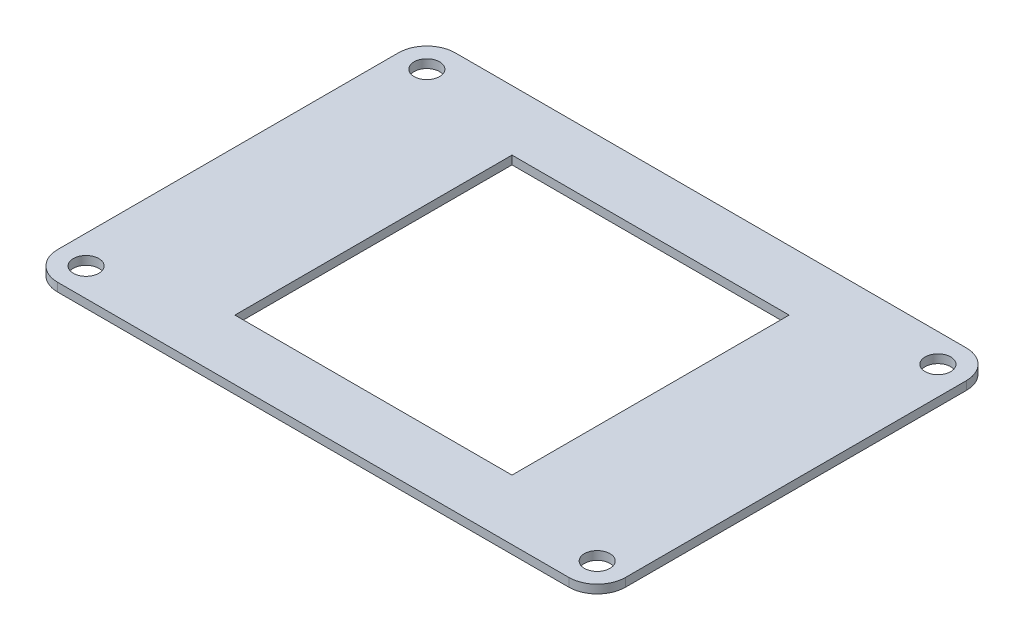
ISO-10303-21;
HEADER;
FILE_DESCRIPTION(('STEP AP214'),'2;1');
FILE_NAME('part.step','',(''),(''),'','','');
FILE_SCHEMA(('AUTOMOTIVE_DESIGN { 1 0 10303 214 1 1 1 1 }'));
ENDSEC;
DATA;
#1=APPLICATION_CONTEXT('core data for automotive mechanical design processes');
#2=APPLICATION_PROTOCOL_DEFINITION('international standard','automotive_design',2000,#1);
#3=PRODUCT_CONTEXT('',#1,'mechanical');
#4=PRODUCT('Part','Part','',(#3));
#5=PRODUCT_RELATED_PRODUCT_CATEGORY('part','',(#4));
#6=PRODUCT_DEFINITION_FORMATION('','',#4);
#7=PRODUCT_DEFINITION_CONTEXT('part definition',#1,'design');
#8=PRODUCT_DEFINITION('design','',#6,#7);
#9=PRODUCT_DEFINITION_SHAPE('','',#8);
#10=(LENGTH_UNIT() NAMED_UNIT(*) SI_UNIT(.MILLI.,.METRE.));
#11=(NAMED_UNIT(*) PLANE_ANGLE_UNIT() SI_UNIT($,.RADIAN.));
#12=(NAMED_UNIT(*) SI_UNIT($,.STERADIAN.) SOLID_ANGLE_UNIT());
#13=UNCERTAINTY_MEASURE_WITH_UNIT(LENGTH_MEASURE(1.E-05),#10,'distance_accuracy_value','');
#14=(GEOMETRIC_REPRESENTATION_CONTEXT(3) GLOBAL_UNCERTAINTY_ASSIGNED_CONTEXT((#13)) GLOBAL_UNIT_ASSIGNED_CONTEXT((#10,
#11,#12)) REPRESENTATION_CONTEXT('',''));
#15=CARTESIAN_POINT('',(0.,0.,0.));
#16=DIRECTION('',(0.,0.,1.));
#17=DIRECTION('',(1.,0.,0.));
#18=AXIS2_PLACEMENT_3D('',#15,#16,#17);
#19=CARTESIAN_POINT('',(-100.,-3.,69.9999999999992));
#20=DIRECTION('',(-1.,0.,0.));
#21=DIRECTION('',(0.,0.,1.));
#22=AXIS2_PLACEMENT_3D('',#19,#20,#21);
#23=PLANE('',#22);
#24=DIRECTION('',(0.,0.,1.));
#25=VECTOR('',#24,1.);
#26=CARTESIAN_POINT('',(-100.,-3.,69.9999999999992));
#27=LINE('',#26,#25);
#28=CARTESIAN_POINT('',(-100.,-3.,-60.));
#29=VERTEX_POINT('',#28);
#30=CARTESIAN_POINT('',(-99.9999999999995,-3.,59.9999999999992));
#31=VERTEX_POINT('',#30);
#32=EDGE_CURVE('E193',#29,#31,#27,.T.);
#33=ORIENTED_EDGE('',*,*,#32,.T.);
#34=DIRECTION('',(0.,1.,0.));
#35=VECTOR('',#34,1.);
#36=CARTESIAN_POINT('',(-99.9999999999995,-3.,59.9999999999992));
#37=LINE('',#36,#35);
#38=CARTESIAN_POINT('',(-99.9999999999998,0.,59.9999999999992));
#39=VERTEX_POINT('',#38);
#40=EDGE_CURVE('E226',#31,#39,#37,.T.);
#41=ORIENTED_EDGE('',*,*,#40,.T.);
#42=DIRECTION('',(0.,0.,1.));
#43=VECTOR('',#42,1.);
#44=CARTESIAN_POINT('',(-100.,0.,69.9999999999992));
#45=LINE('',#44,#43);
#46=CARTESIAN_POINT('',(-100.,0.,-60.));
#47=VERTEX_POINT('',#46);
#48=EDGE_CURVE('E187',#47,#39,#45,.T.);
#49=ORIENTED_EDGE('',*,*,#48,.F.);
#50=DIRECTION('',(0.,1.,0.));
#51=VECTOR('',#50,1.);
#52=CARTESIAN_POINT('',(-100.,-3.,-60.));
#53=LINE('',#52,#51);
#54=EDGE_CURVE('E209',#47,#29,#53,.F.);
#55=ORIENTED_EDGE('',*,*,#54,.T.);
#56=EDGE_LOOP('',(#33,#41,#49,#55));
#57=FACE_BOUND('',#56,.T.);
#58=ADVANCED_FACE('F42',(#57),#23,.T.);
#59=CARTESIAN_POINT('',(100.,-2.99999999999934,-70.));
#60=DIRECTION('',(0.,0.,-1.));
#61=DIRECTION('',(-1.,0.,0.));
#62=AXIS2_PLACEMENT_3D('',#59,#60,#61);
#63=PLANE('',#62);
#64=DIRECTION('',(-1.,0.,0.));
#65=VECTOR('',#64,1.);
#66=CARTESIAN_POINT('',(100.,6.66133814775094E-13,-70.));
#67=LINE('',#66,#65);
#68=CARTESIAN_POINT('',(90.0000000000002,4.9960036108132E-13,-70.));
#69=VERTEX_POINT('',#68);
#70=CARTESIAN_POINT('',(-89.9999999999998,4.9960036108132E-13,-70.));
#71=VERTEX_POINT('',#70);
#72=EDGE_CURVE('E198',#69,#71,#67,.T.);
#73=ORIENTED_EDGE('',*,*,#72,.F.);
#74=DIRECTION('',(0.,1.,0.));
#75=VECTOR('',#74,1.);
#76=CARTESIAN_POINT('',(90.0000000000005,-2.9999999999995,-70.));
#77=LINE('',#76,#75);
#78=CARTESIAN_POINT('',(90.0000000000005,-2.9999999999995,-70.));
#79=VERTEX_POINT('',#78);
#80=EDGE_CURVE('E11',#69,#79,#77,.F.);
#81=ORIENTED_EDGE('',*,*,#80,.T.);
#82=DIRECTION('',(-1.,0.,0.));
#83=VECTOR('',#82,1.);
#84=CARTESIAN_POINT('',(100.,-2.99999999999934,-70.));
#85=LINE('',#84,#83);
#86=CARTESIAN_POINT('',(-89.9999999999995,-2.9999999999995,-70.));
#87=VERTEX_POINT('',#86);
#88=EDGE_CURVE('E205',#79,#87,#85,.T.);
#89=ORIENTED_EDGE('',*,*,#88,.T.);
#90=DIRECTION('',(0.,1.,0.));
#91=VECTOR('',#90,1.);
#92=CARTESIAN_POINT('',(-89.9999999999995,-2.9999999999995,-70.));
#93=LINE('',#92,#91);
#94=EDGE_CURVE('E51',#87,#71,#93,.T.);
#95=ORIENTED_EDGE('',*,*,#94,.T.);
#96=EDGE_LOOP('',(#73,#81,#89,#95));
#97=FACE_BOUND('',#96,.T.);
#98=ADVANCED_FACE('F272',(#97),#63,.T.);
#99=CARTESIAN_POINT('',(100.,-2.99999999999995,70.));
#100=DIRECTION('',(1.,0.,0.));
#101=DIRECTION('',(0.,0.,-1.));
#102=AXIS2_PLACEMENT_3D('',#99,#100,#101);
#103=PLANE('',#102);
#104=DIRECTION('',(0.,0.,-1.));
#105=VECTOR('',#104,1.);
#106=CARTESIAN_POINT('',(100.,-2.99999999999995,70.));
#107=LINE('',#106,#105);
#108=CARTESIAN_POINT('',(100.,-2.99999999999995,60.));
#109=VERTEX_POINT('',#108);
#110=CARTESIAN_POINT('',(100.,-3.,-60.));
#111=VERTEX_POINT('',#110);
#112=EDGE_CURVE('E202',#109,#111,#107,.T.);
#113=ORIENTED_EDGE('',*,*,#112,.T.);
#114=DIRECTION('',(0.,1.,0.));
#115=VECTOR('',#114,1.);
#116=CARTESIAN_POINT('',(100.,-3.,-60.));
#117=LINE('',#116,#115);
#118=CARTESIAN_POINT('',(99.9999999999997,0.,-60.));
#119=VERTEX_POINT('',#118);
#120=EDGE_CURVE('E262',#111,#119,#117,.T.);
#121=ORIENTED_EDGE('',*,*,#120,.T.);
#122=DIRECTION('',(0.,0.,-1.));
#123=VECTOR('',#122,1.);
#124=CARTESIAN_POINT('',(99.9999999999997,0.,70.));
#125=LINE('',#124,#123);
#126=CARTESIAN_POINT('',(100.,0.,60.));
#127=VERTEX_POINT('',#126);
#128=EDGE_CURVE('E217',#127,#119,#125,.T.);
#129=ORIENTED_EDGE('',*,*,#128,.F.);
#130=DIRECTION('',(0.,1.,0.));
#131=VECTOR('',#130,1.);
#132=CARTESIAN_POINT('',(100.,-2.99999999999995,60.));
#133=LINE('',#132,#131);
#134=EDGE_CURVE('E65',#127,#109,#133,.F.);
#135=ORIENTED_EDGE('',*,*,#134,.T.);
#136=EDGE_LOOP('',(#113,#121,#129,#135));
#137=FACE_BOUND('',#136,.T.);
#138=ADVANCED_FACE('F282',(#137),#103,.T.);
#139=CARTESIAN_POINT('',(100.,-2.99999999999995,70.));
#140=DIRECTION('',(0.,0.,1.));
#141=DIRECTION('',(1.,0.,0.));
#142=AXIS2_PLACEMENT_3D('',#139,#140,#141);
#143=PLANE('',#142);
#144=DIRECTION('',(1.,0.,0.));
#145=VECTOR('',#144,1.);
#146=CARTESIAN_POINT('',(99.9999999999997,0.,70.));
#147=LINE('',#146,#145);
#148=CARTESIAN_POINT('',(-90.0000000000003,0.,69.9999999999992));
#149=VERTEX_POINT('',#148);
#150=CARTESIAN_POINT('',(89.9999999999997,0.,70.));
#151=VERTEX_POINT('',#150);
#152=EDGE_CURVE('E213',#149,#151,#147,.T.);
#153=ORIENTED_EDGE('',*,*,#152,.F.);
#154=DIRECTION('',(0.,1.,0.));
#155=VECTOR('',#154,1.);
#156=CARTESIAN_POINT('',(-90.,-3.,69.9999999999992));
#157=LINE('',#156,#155);
#158=CARTESIAN_POINT('',(-90.,-3.,69.9999999999992));
#159=VERTEX_POINT('',#158);
#160=EDGE_CURVE('E246',#149,#159,#157,.F.);
#161=ORIENTED_EDGE('',*,*,#160,.T.);
#162=DIRECTION('',(1.,0.,0.));
#163=VECTOR('',#162,1.);
#164=CARTESIAN_POINT('',(100.,-2.99999999999995,70.));
#165=LINE('',#164,#163);
#166=CARTESIAN_POINT('',(90.,-3.,70.));
#167=VERTEX_POINT('',#166);
#168=EDGE_CURVE('E197',#159,#167,#165,.T.);
#169=ORIENTED_EDGE('',*,*,#168,.T.);
#170=DIRECTION('',(0.,1.,0.));
#171=VECTOR('',#170,1.);
#172=CARTESIAN_POINT('',(90.,-3.,70.));
#173=LINE('',#172,#171);
#174=EDGE_CURVE('E242',#167,#151,#173,.T.);
#175=ORIENTED_EDGE('',*,*,#174,.T.);
#176=EDGE_LOOP('',(#153,#161,#169,#175));
#177=FACE_BOUND('',#176,.T.);
#178=ADVANCED_FACE('F289',(#177),#143,.T.);
#179=CARTESIAN_POINT('',(0.,-3.,0.));
#180=DIRECTION('',(0.,1.,0.));
#181=DIRECTION('',(0.,0.,1.));
#182=AXIS2_PLACEMENT_3D('',#179,#180,#181);
#183=PLANE('',#182);
#184=CARTESIAN_POINT('',(-90.,-3.,-60.));
#185=DIRECTION('',(0.,1.,0.));
#186=DIRECTION('',(0.,0.,1.));
#187=AXIS2_PLACEMENT_3D('',#184,#185,#186);
#188=CIRCLE('',#187,4.50000000000001);
#189=CARTESIAN_POINT('',(-90.,-3.,-55.5));
#190=VERTEX_POINT('',#189);
#191=EDGE_CURVE('E555',#190,#190,#188,.T.);
#192=ORIENTED_EDGE('',*,*,#191,.T.);
#193=EDGE_LOOP('',(#192));
#194=FACE_BOUND('',#193,.T.);
#195=CARTESIAN_POINT('',(-89.9999999999995,-3.,59.9999999999992));
#196=DIRECTION('',(0.,1.,0.));
#197=DIRECTION('',(0.,0.,1.));
#198=AXIS2_PLACEMENT_3D('',#195,#196,#197);
#199=CIRCLE('',#198,4.50000000000001);
#200=CARTESIAN_POINT('',(-89.9999999999995,-3.,64.4999999999992));
#201=VERTEX_POINT('',#200);
#202=EDGE_CURVE('E550',#201,#201,#199,.T.);
#203=ORIENTED_EDGE('',*,*,#202,.T.);
#204=EDGE_LOOP('',(#203));
#205=FACE_BOUND('',#204,.T.);
#206=CARTESIAN_POINT('',(90.0000000000005,-3.,60.));
#207=DIRECTION('',(0.,1.,0.));
#208=DIRECTION('',(0.,0.,1.));
#209=AXIS2_PLACEMENT_3D('',#206,#207,#208);
#210=CIRCLE('',#209,4.50000000000001);
#211=CARTESIAN_POINT('',(90.0000000000005,-3.,64.5));
#212=VERTEX_POINT('',#211);
#213=EDGE_CURVE('E539',#212,#212,#210,.T.);
#214=ORIENTED_EDGE('',*,*,#213,.T.);
#215=EDGE_LOOP('',(#214));
#216=FACE_BOUND('',#215,.T.);
#217=CARTESIAN_POINT('',(90.,-3.,-60.));
#218=DIRECTION('',(0.,1.,0.));
#219=DIRECTION('',(0.,0.,1.));
#220=AXIS2_PLACEMENT_3D('',#217,#218,#219);
#221=CIRCLE('',#220,4.50000000000001);
#222=CARTESIAN_POINT('',(90.,-3.,-55.5));
#223=VERTEX_POINT('',#222);
#224=EDGE_CURVE('E178',#223,#223,#221,.T.);
#225=ORIENTED_EDGE('',*,*,#224,.T.);
#226=EDGE_LOOP('',(#225));
#227=FACE_BOUND('',#226,.T.);
#228=DIRECTION('',(-1.,0.,0.));
#229=VECTOR('',#228,1.);
#230=CARTESIAN_POINT('',(48.7999999999999,-2.99999999999995,-48.8));
#231=LINE('',#230,#229);
#232=CARTESIAN_POINT('',(48.7999999999999,-2.99999999999995,-48.8));
#233=VERTEX_POINT('',#232);
#234=CARTESIAN_POINT('',(-48.8000000000001,-3.,-48.8));
#235=VERTEX_POINT('',#234);
#236=EDGE_CURVE('E146',#233,#235,#231,.T.);
#237=ORIENTED_EDGE('',*,*,#236,.T.);
#238=DIRECTION('',(0.,0.,1.));
#239=VECTOR('',#238,1.);
#240=CARTESIAN_POINT('',(-48.8000000000003,-2.99999999999917,48.7999999999992));
#241=LINE('',#240,#239);
#242=CARTESIAN_POINT('',(-48.8000000000003,-2.99999999999917,48.7999999999992));
#243=VERTEX_POINT('',#242);
#244=EDGE_CURVE('E137',#235,#243,#241,.T.);
#245=ORIENTED_EDGE('',*,*,#244,.T.);
#246=DIRECTION('',(1.,0.,0.));
#247=VECTOR('',#246,1.);
#248=CARTESIAN_POINT('',(48.7999999999997,-2.99999999999917,48.7999999999999));
#249=LINE('',#248,#247);
#250=CARTESIAN_POINT('',(48.7999999999997,-2.99999999999917,48.7999999999999));
#251=VERTEX_POINT('',#250);
#252=EDGE_CURVE('E150',#243,#251,#249,.T.);
#253=ORIENTED_EDGE('',*,*,#252,.T.);
#254=DIRECTION('',(0.,0.,-1.));
#255=VECTOR('',#254,1.);
#256=CARTESIAN_POINT('',(48.7999999999997,-2.99999999999917,48.7999999999999));
#257=LINE('',#256,#255);
#258=EDGE_CURVE('E155',#251,#233,#257,.T.);
#259=ORIENTED_EDGE('',*,*,#258,.T.);
#260=EDGE_LOOP('',(#237,#245,#253,#259));
#261=FACE_BOUND('',#260,.T.);
#262=ORIENTED_EDGE('',*,*,#168,.F.);
#263=CARTESIAN_POINT('',(-89.9999999999995,-3.,59.9999999999992));
#264=DIRECTION('',(0.,1.,0.));
#265=DIRECTION('',(0.,0.,1.));
#266=AXIS2_PLACEMENT_3D('',#263,#264,#265);
#267=CIRCLE('',#266,10.);
#268=EDGE_CURVE('E257',#159,#31,#267,.F.);
#269=ORIENTED_EDGE('',*,*,#268,.T.);
#270=ORIENTED_EDGE('',*,*,#32,.F.);
#271=CARTESIAN_POINT('',(-90.,-3.,-60.));
#272=DIRECTION('',(0.,1.,0.));
#273=DIRECTION('',(0.,0.,1.));
#274=AXIS2_PLACEMENT_3D('',#271,#272,#273);
#275=CIRCLE('',#274,10.);
#276=EDGE_CURVE('E252',#29,#87,#275,.F.);
#277=ORIENTED_EDGE('',*,*,#276,.T.);
#278=ORIENTED_EDGE('',*,*,#88,.F.);
#279=CARTESIAN_POINT('',(90.,-3.,-60.));
#280=DIRECTION('',(0.,1.,0.));
#281=DIRECTION('',(0.,0.,1.));
#282=AXIS2_PLACEMENT_3D('',#279,#280,#281);
#283=CIRCLE('',#282,10.);
#284=EDGE_CURVE('E58',#79,#111,#283,.F.);
#285=ORIENTED_EDGE('',*,*,#284,.T.);
#286=ORIENTED_EDGE('',*,*,#112,.F.);
#287=CARTESIAN_POINT('',(90.0000000000005,-3.,60.));
#288=DIRECTION('',(0.,1.,0.));
#289=DIRECTION('',(0.,0.,1.));
#290=AXIS2_PLACEMENT_3D('',#287,#288,#289);
#291=CIRCLE('',#290,10.);
#292=EDGE_CURVE('E249',#109,#167,#291,.F.);
#293=ORIENTED_EDGE('',*,*,#292,.T.);
#294=EDGE_LOOP('',(#262,#269,#270,#277,#278,#285,#286,#293));
#295=FACE_BOUND('',#294,.T.);
#296=ADVANCED_FACE('F157',(#194,#205,#216,#227,#261,#295),#183,.F.);
#297=CARTESIAN_POINT('',(0.,0.,0.));
#298=DIRECTION('',(0.,1.,0.));
#299=DIRECTION('',(0.,0.,1.));
#300=AXIS2_PLACEMENT_3D('',#297,#298,#299);
#301=PLANE('',#300);
#302=CARTESIAN_POINT('',(-90.0000000000003,0.,-60.));
#303=DIRECTION('',(0.,1.,0.));
#304=DIRECTION('',(0.,0.,1.));
#305=AXIS2_PLACEMENT_3D('',#302,#303,#304);
#306=CIRCLE('',#305,4.50000000000001);
#307=CARTESIAN_POINT('',(-90.0000000000003,0.,-55.5));
#308=VERTEX_POINT('',#307);
#309=EDGE_CURVE('E524',#308,#308,#306,.T.);
#310=ORIENTED_EDGE('',*,*,#309,.F.);
#311=EDGE_LOOP('',(#310));
#312=FACE_BOUND('',#311,.T.);
#313=CARTESIAN_POINT('',(-89.9999999999998,0.,59.9999999999992));
#314=DIRECTION('',(0.,1.,0.));
#315=DIRECTION('',(0.,0.,1.));
#316=AXIS2_PLACEMENT_3D('',#313,#314,#315);
#317=CIRCLE('',#316,4.50000000000001);
#318=CARTESIAN_POINT('',(-89.9999999999998,0.,64.4999999999992));
#319=VERTEX_POINT('',#318);
#320=EDGE_CURVE('E528',#319,#319,#317,.T.);
#321=ORIENTED_EDGE('',*,*,#320,.F.);
#322=EDGE_LOOP('',(#321));
#323=FACE_BOUND('',#322,.T.);
#324=CARTESIAN_POINT('',(90.0000000000002,0.,60.));
#325=DIRECTION('',(0.,1.,0.));
#326=DIRECTION('',(0.,0.,1.));
#327=AXIS2_PLACEMENT_3D('',#324,#325,#326);
#328=CIRCLE('',#327,4.50000000000001);
#329=CARTESIAN_POINT('',(90.0000000000002,0.,64.5));
#330=VERTEX_POINT('',#329);
#331=EDGE_CURVE('E532',#330,#330,#328,.T.);
#332=ORIENTED_EDGE('',*,*,#331,.F.);
#333=EDGE_LOOP('',(#332));
#334=FACE_BOUND('',#333,.T.);
#335=CARTESIAN_POINT('',(89.9999999999997,0.,-60.));
#336=DIRECTION('',(0.,1.,0.));
#337=DIRECTION('',(0.,0.,1.));
#338=AXIS2_PLACEMENT_3D('',#335,#336,#337);
#339=CIRCLE('',#338,4.50000000000001);
#340=CARTESIAN_POINT('',(89.9999999999997,0.,-55.5));
#341=VERTEX_POINT('',#340);
#342=EDGE_CURVE('E168',#341,#341,#339,.T.);
#343=ORIENTED_EDGE('',*,*,#342,.F.);
#344=EDGE_LOOP('',(#343));
#345=FACE_BOUND('',#344,.T.);
#346=DIRECTION('',(0.,0.,1.));
#347=VECTOR('',#346,1.);
#348=CARTESIAN_POINT('',(-48.8000000000001,8.32667268468867E-13,48.7999999999992));
#349=LINE('',#348,#347);
#350=CARTESIAN_POINT('',(-48.8,0.,-48.8));
#351=VERTEX_POINT('',#350);
#352=CARTESIAN_POINT('',(-48.8000000000001,8.32667268468867E-13,48.7999999999992));
#353=VERTEX_POINT('',#352);
#354=EDGE_CURVE('E140',#351,#353,#349,.T.);
#355=ORIENTED_EDGE('',*,*,#354,.F.);
#356=DIRECTION('',(-1.,0.,0.));
#357=VECTOR('',#356,1.);
#358=CARTESIAN_POINT('',(48.8,0.,-48.8));
#359=LINE('',#358,#357);
#360=CARTESIAN_POINT('',(48.8,0.,-48.8));
#361=VERTEX_POINT('',#360);
#362=EDGE_CURVE('E160',#361,#351,#359,.T.);
#363=ORIENTED_EDGE('',*,*,#362,.F.);
#364=DIRECTION('',(0.,0.,-1.));
#365=VECTOR('',#364,1.);
#366=CARTESIAN_POINT('',(48.7999999999999,8.32667268468867E-13,48.7999999999999));
#367=LINE('',#366,#365);
#368=CARTESIAN_POINT('',(48.7999999999999,8.32667268468867E-13,48.7999999999999));
#369=VERTEX_POINT('',#368);
#370=EDGE_CURVE('E165',#369,#361,#367,.T.);
#371=ORIENTED_EDGE('',*,*,#370,.F.);
#372=DIRECTION('',(1.,0.,0.));
#373=VECTOR('',#372,1.);
#374=CARTESIAN_POINT('',(48.7999999999999,8.32667268468867E-13,48.7999999999999));
#375=LINE('',#374,#373);
#376=EDGE_CURVE('E177',#353,#369,#375,.T.);
#377=ORIENTED_EDGE('',*,*,#376,.F.);
#378=EDGE_LOOP('',(#355,#363,#371,#377));
#379=FACE_BOUND('',#378,.T.);
#380=ORIENTED_EDGE('',*,*,#48,.T.);
#381=CARTESIAN_POINT('',(-89.9999999999998,0.,59.9999999999992));
#382=DIRECTION('',(0.,1.,0.));
#383=DIRECTION('',(0.,0.,1.));
#384=AXIS2_PLACEMENT_3D('',#381,#382,#383);
#385=CIRCLE('',#384,10.);
#386=EDGE_CURVE('E239',#39,#149,#385,.T.);
#387=ORIENTED_EDGE('',*,*,#386,.T.);
#388=ORIENTED_EDGE('',*,*,#152,.T.);
#389=CARTESIAN_POINT('',(90.0000000000002,0.,60.));
#390=DIRECTION('',(0.,1.,0.));
#391=DIRECTION('',(0.,0.,1.));
#392=AXIS2_PLACEMENT_3D('',#389,#390,#391);
#393=CIRCLE('',#392,10.);
#394=EDGE_CURVE('E230',#151,#127,#393,.T.);
#395=ORIENTED_EDGE('',*,*,#394,.T.);
#396=ORIENTED_EDGE('',*,*,#128,.T.);
#397=CARTESIAN_POINT('',(89.9999999999997,0.,-60.));
#398=DIRECTION('',(0.,1.,0.));
#399=DIRECTION('',(0.,0.,1.));
#400=AXIS2_PLACEMENT_3D('',#397,#398,#399);
#401=CIRCLE('',#400,10.);
#402=EDGE_CURVE('E236',#119,#69,#401,.T.);
#403=ORIENTED_EDGE('',*,*,#402,.T.);
#404=ORIENTED_EDGE('',*,*,#72,.T.);
#405=CARTESIAN_POINT('',(-90.0000000000003,0.,-60.));
#406=DIRECTION('',(0.,1.,0.));
#407=DIRECTION('',(0.,0.,1.));
#408=AXIS2_PLACEMENT_3D('',#405,#406,#407);
#409=CIRCLE('',#408,10.);
#410=EDGE_CURVE('E233',#71,#47,#409,.T.);
#411=ORIENTED_EDGE('',*,*,#410,.T.);
#412=EDGE_LOOP('',(#380,#387,#388,#395,#396,#403,#404,#411));
#413=FACE_BOUND('',#412,.T.);
#414=ADVANCED_FACE('F277',(#312,#323,#334,#345,#379,#413),#301,.T.);
#415=CARTESIAN_POINT('',(-48.8000000000003,-2.99999999999917,48.7999999999992));
#416=DIRECTION('',(-1.,0.,0.));
#417=DIRECTION('',(0.,0.,1.));
#418=AXIS2_PLACEMENT_3D('',#415,#416,#417);
#419=PLANE('',#418);
#420=ORIENTED_EDGE('',*,*,#354,.T.);
#421=DIRECTION('',(0.,1.,0.));
#422=VECTOR('',#421,1.);
#423=CARTESIAN_POINT('',(-48.8000000000003,-2.99999999999917,48.7999999999992));
#424=LINE('',#423,#422);
#425=EDGE_CURVE('E133',#243,#353,#424,.T.);
#426=ORIENTED_EDGE('',*,*,#425,.F.);
#427=ORIENTED_EDGE('',*,*,#244,.F.);
#428=DIRECTION('',(0.,1.,0.));
#429=VECTOR('',#428,1.);
#430=CARTESIAN_POINT('',(-48.8000000000001,-3.,-48.8));
#431=LINE('',#430,#429);
#432=EDGE_CURVE('E184',#235,#351,#431,.T.);
#433=ORIENTED_EDGE('',*,*,#432,.T.);
#434=EDGE_LOOP('',(#420,#426,#427,#433));
#435=FACE_BOUND('',#434,.T.);
#436=ADVANCED_FACE('F135',(#435),#419,.F.);
#437=CARTESIAN_POINT('',(48.7999999999999,-2.99999999999995,-48.8));
#438=DIRECTION('',(0.,0.,-1.));
#439=DIRECTION('',(-1.,0.,0.));
#440=AXIS2_PLACEMENT_3D('',#437,#438,#439);
#441=PLANE('',#440);
#442=ORIENTED_EDGE('',*,*,#362,.T.);
#443=ORIENTED_EDGE('',*,*,#432,.F.);
#444=ORIENTED_EDGE('',*,*,#236,.F.);
#445=DIRECTION('',(0.,1.,0.));
#446=VECTOR('',#445,1.);
#447=CARTESIAN_POINT('',(48.7999999999999,-2.99999999999995,-48.8));
#448=LINE('',#447,#446);
#449=EDGE_CURVE('E188',#233,#361,#448,.T.);
#450=ORIENTED_EDGE('',*,*,#449,.T.);
#451=EDGE_LOOP('',(#442,#443,#444,#450));
#452=FACE_BOUND('',#451,.T.);
#453=ADVANCED_FACE('F338',(#452),#441,.F.);
#454=CARTESIAN_POINT('',(48.7999999999997,-2.99999999999917,48.7999999999999));
#455=DIRECTION('',(1.,0.,0.));
#456=DIRECTION('',(0.,0.,-1.));
#457=AXIS2_PLACEMENT_3D('',#454,#455,#456);
#458=PLANE('',#457);
#459=ORIENTED_EDGE('',*,*,#370,.T.);
#460=ORIENTED_EDGE('',*,*,#449,.F.);
#461=ORIENTED_EDGE('',*,*,#258,.F.);
#462=DIRECTION('',(0.,1.,0.));
#463=VECTOR('',#462,1.);
#464=CARTESIAN_POINT('',(48.7999999999997,-2.99999999999917,48.7999999999999));
#465=LINE('',#464,#463);
#466=EDGE_CURVE('E145',#251,#369,#465,.T.);
#467=ORIENTED_EDGE('',*,*,#466,.T.);
#468=EDGE_LOOP('',(#459,#460,#461,#467));
#469=FACE_BOUND('',#468,.T.);
#470=ADVANCED_FACE('F341',(#469),#458,.F.);
#471=CARTESIAN_POINT('',(48.7999999999997,-2.99999999999917,48.7999999999999));
#472=DIRECTION('',(0.,0.,1.));
#473=DIRECTION('',(1.,0.,0.));
#474=AXIS2_PLACEMENT_3D('',#471,#472,#473);
#475=PLANE('',#474);
#476=ORIENTED_EDGE('',*,*,#376,.T.);
#477=ORIENTED_EDGE('',*,*,#466,.F.);
#478=ORIENTED_EDGE('',*,*,#252,.F.);
#479=ORIENTED_EDGE('',*,*,#425,.T.);
#480=EDGE_LOOP('',(#476,#477,#478,#479));
#481=FACE_BOUND('',#480,.T.);
#482=ADVANCED_FACE('F151',(#481),#475,.F.);
#483=CARTESIAN_POINT('',(90.,-3.,-60.));
#484=DIRECTION('',(0.,1.,0.));
#485=DIRECTION('',(0.,0.,1.));
#486=AXIS2_PLACEMENT_3D('',#483,#484,#485);
#487=CYLINDRICAL_SURFACE('',#486,4.50000000000001);
#488=ORIENTED_EDGE('',*,*,#224,.F.);
#489=EDGE_LOOP('',(#488));
#490=FACE_BOUND('',#489,.T.);
#491=ORIENTED_EDGE('',*,*,#342,.T.);
#492=EDGE_LOOP('',(#491));
#493=FACE_BOUND('',#492,.T.);
#494=ADVANCED_FACE('F333',(#490,#493),#487,.F.);
#495=CARTESIAN_POINT('',(90.0000000000005,-3.,60.));
#496=DIRECTION('',(0.,1.,0.));
#497=DIRECTION('',(0.,0.,1.));
#498=AXIS2_PLACEMENT_3D('',#495,#496,#497);
#499=CYLINDRICAL_SURFACE('',#498,4.50000000000001);
#500=ORIENTED_EDGE('',*,*,#213,.F.);
#501=EDGE_LOOP('',(#500));
#502=FACE_BOUND('',#501,.T.);
#503=ORIENTED_EDGE('',*,*,#331,.T.);
#504=EDGE_LOOP('',(#503));
#505=FACE_BOUND('',#504,.T.);
#506=ADVANCED_FACE('F325',(#502,#505),#499,.F.);
#507=CARTESIAN_POINT('',(-89.9999999999995,-3.,59.9999999999992));
#508=DIRECTION('',(0.,1.,0.));
#509=DIRECTION('',(0.,0.,1.));
#510=AXIS2_PLACEMENT_3D('',#507,#508,#509);
#511=CYLINDRICAL_SURFACE('',#510,4.50000000000001);
#512=ORIENTED_EDGE('',*,*,#202,.F.);
#513=EDGE_LOOP('',(#512));
#514=FACE_BOUND('',#513,.T.);
#515=ORIENTED_EDGE('',*,*,#320,.T.);
#516=EDGE_LOOP('',(#515));
#517=FACE_BOUND('',#516,.T.);
#518=ADVANCED_FACE('F319',(#514,#517),#511,.F.);
#519=CARTESIAN_POINT('',(-90.,-3.,-60.));
#520=DIRECTION('',(0.,1.,0.));
#521=DIRECTION('',(0.,0.,1.));
#522=AXIS2_PLACEMENT_3D('',#519,#520,#521);
#523=CYLINDRICAL_SURFACE('',#522,4.50000000000001);
#524=ORIENTED_EDGE('',*,*,#191,.F.);
#525=EDGE_LOOP('',(#524));
#526=FACE_BOUND('',#525,.T.);
#527=ORIENTED_EDGE('',*,*,#309,.T.);
#528=EDGE_LOOP('',(#527));
#529=FACE_BOUND('',#528,.T.);
#530=ADVANCED_FACE('F315',(#526,#529),#523,.F.);
#531=CARTESIAN_POINT('',(-89.9999999999995,-3.,59.9999999999992));
#532=DIRECTION('',(0.,1.,0.));
#533=DIRECTION('',(0.,0.,1.));
#534=AXIS2_PLACEMENT_3D('',#531,#532,#533);
#535=CYLINDRICAL_SURFACE('',#534,10.);
#536=ORIENTED_EDGE('',*,*,#268,.F.);
#537=ORIENTED_EDGE('',*,*,#160,.F.);
#538=ORIENTED_EDGE('',*,*,#386,.F.);
#539=ORIENTED_EDGE('',*,*,#40,.F.);
#540=EDGE_LOOP('',(#536,#537,#538,#539));
#541=FACE_BOUND('',#540,.T.);
#542=ADVANCED_FACE('F294',(#541),#535,.T.);
#543=CARTESIAN_POINT('',(90.,-3.,-60.));
#544=DIRECTION('',(0.,1.,0.));
#545=DIRECTION('',(0.,0.,1.));
#546=AXIS2_PLACEMENT_3D('',#543,#544,#545);
#547=CYLINDRICAL_SURFACE('',#546,10.);
#548=ORIENTED_EDGE('',*,*,#284,.F.);
#549=ORIENTED_EDGE('',*,*,#80,.F.);
#550=ORIENTED_EDGE('',*,*,#402,.F.);
#551=ORIENTED_EDGE('',*,*,#120,.F.);
#552=EDGE_LOOP('',(#548,#549,#550,#551));
#553=FACE_BOUND('',#552,.T.);
#554=ADVANCED_FACE('F281',(#553),#547,.T.);
#555=CARTESIAN_POINT('',(-90.,-3.,-60.));
#556=DIRECTION('',(0.,1.,0.));
#557=DIRECTION('',(0.,0.,1.));
#558=AXIS2_PLACEMENT_3D('',#555,#556,#557);
#559=CYLINDRICAL_SURFACE('',#558,10.);
#560=ORIENTED_EDGE('',*,*,#276,.F.);
#561=ORIENTED_EDGE('',*,*,#54,.F.);
#562=ORIENTED_EDGE('',*,*,#410,.F.);
#563=ORIENTED_EDGE('',*,*,#94,.F.);
#564=EDGE_LOOP('',(#560,#561,#562,#563));
#565=FACE_BOUND('',#564,.T.);
#566=ADVANCED_FACE('F298',(#565),#559,.T.);
#567=CARTESIAN_POINT('',(90.0000000000005,-3.,60.));
#568=DIRECTION('',(0.,1.,0.));
#569=DIRECTION('',(0.,0.,1.));
#570=AXIS2_PLACEMENT_3D('',#567,#568,#569);
#571=CYLINDRICAL_SURFACE('',#570,10.);
#572=ORIENTED_EDGE('',*,*,#292,.F.);
#573=ORIENTED_EDGE('',*,*,#134,.F.);
#574=ORIENTED_EDGE('',*,*,#394,.F.);
#575=ORIENTED_EDGE('',*,*,#174,.F.);
#576=EDGE_LOOP('',(#572,#573,#574,#575));
#577=FACE_BOUND('',#576,.T.);
#578=ADVANCED_FACE('F44',(#577),#571,.T.);
#579=CLOSED_SHELL('',(#58,#98,#138,#178,#296,#414,#436,#453,#470,#482,#494,#506,#518,#530,#542,
#554,#566,#578));
#580=MANIFOLD_SOLID_BREP('B2',#579);
#581=ADVANCED_BREP_SHAPE_REPRESENTATION('',(#18,#580),#14);
#582=SHAPE_DEFINITION_REPRESENTATION(#9,#581);
ENDSEC;
END-ISO-10303-21;
